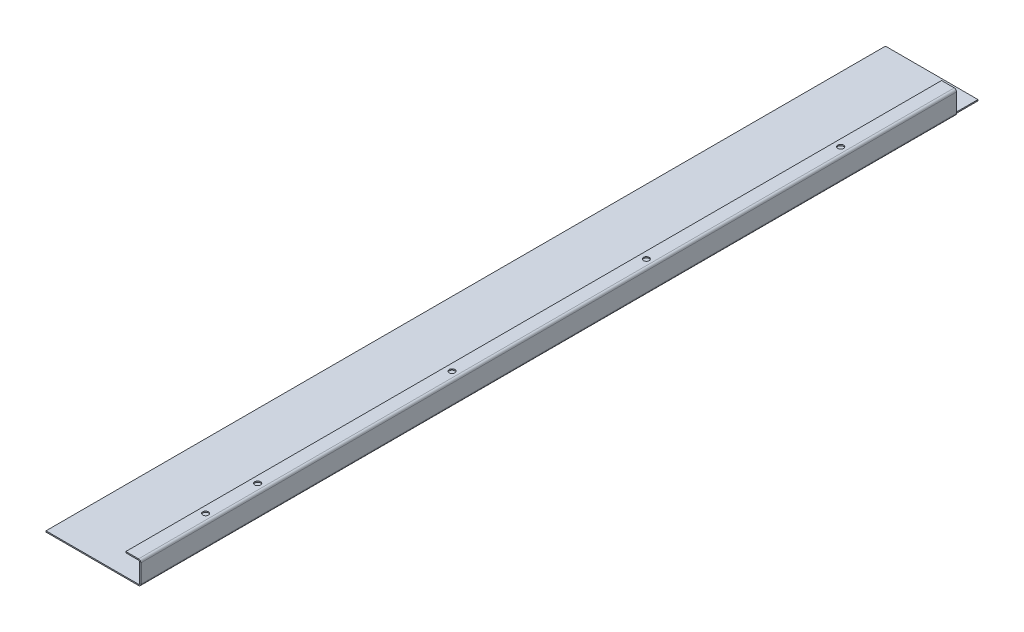
ISO-10303-21;
HEADER;
FILE_DESCRIPTION(('STEP AP214'),'2;1');
FILE_NAME('part.step','',(''),(''),'','','');
FILE_SCHEMA(('AUTOMOTIVE_DESIGN { 1 0 10303 214 1 1 1 1 }'));
ENDSEC;
DATA;
#1=APPLICATION_CONTEXT('core data for automotive mechanical design processes');
#2=APPLICATION_PROTOCOL_DEFINITION('international standard','automotive_design',2000,#1);
#3=PRODUCT_CONTEXT('',#1,'mechanical');
#4=PRODUCT('Part','Part','',(#3));
#5=PRODUCT_RELATED_PRODUCT_CATEGORY('part','',(#4));
#6=PRODUCT_DEFINITION_FORMATION('','',#4);
#7=PRODUCT_DEFINITION_CONTEXT('part definition',#1,'design');
#8=PRODUCT_DEFINITION('design','',#6,#7);
#9=PRODUCT_DEFINITION_SHAPE('','',#8);
#10=(LENGTH_UNIT() NAMED_UNIT(*) SI_UNIT(.MILLI.,.METRE.));
#11=(NAMED_UNIT(*) PLANE_ANGLE_UNIT() SI_UNIT($,.RADIAN.));
#12=(NAMED_UNIT(*) SI_UNIT($,.STERADIAN.) SOLID_ANGLE_UNIT());
#13=UNCERTAINTY_MEASURE_WITH_UNIT(LENGTH_MEASURE(1.E-05),#10,'distance_accuracy_value','');
#14=(GEOMETRIC_REPRESENTATION_CONTEXT(3) GLOBAL_UNCERTAINTY_ASSIGNED_CONTEXT((#13)) GLOBAL_UNIT_ASSIGNED_CONTEXT((#10,
#11,#12)) REPRESENTATION_CONTEXT('',''));
#15=CARTESIAN_POINT('',(0.,0.,0.));
#16=DIRECTION('',(0.,0.,1.));
#17=DIRECTION('',(1.,0.,0.));
#18=AXIS2_PLACEMENT_3D('',#15,#16,#17);
#19=CARTESIAN_POINT('',(82.,-3.02959534033787E-13,0.));
#20=DIRECTION('',(-1.,0.,0.));
#21=DIRECTION('',(0.,-1.,0.));
#22=AXIS2_PLACEMENT_3D('',#19,#20,#21);
#23=PLANE('',#22);
#24=DIRECTION('',(0.,-1.,0.));
#25=VECTOR('',#24,1.);
#26=CARTESIAN_POINT('',(81.9999999999999,0.,-705.2));
#27=LINE('',#26,#25);
#28=CARTESIAN_POINT('',(81.9999999999999,17.,-705.2));
#29=VERTEX_POINT('',#28);
#30=CARTESIAN_POINT('',(81.9999999999998,0.999999999999959,-705.2));
#31=VERTEX_POINT('',#30);
#32=EDGE_CURVE('E346',#29,#31,#27,.T.);
#33=ORIENTED_EDGE('',*,*,#32,.F.);
#34=DIRECTION('',(0.,0.,-1.));
#35=VECTOR('',#34,1.);
#36=CARTESIAN_POINT('',(82.,17.,-725.7));
#37=LINE('',#36,#35);
#38=CARTESIAN_POINT('',(82.,17.,0.));
#39=VERTEX_POINT('',#38);
#40=EDGE_CURVE('E216',#29,#39,#37,.F.);
#41=ORIENTED_EDGE('',*,*,#40,.T.);
#42=DIRECTION('',(0.,-1.,0.));
#43=VECTOR('',#42,1.);
#44=CARTESIAN_POINT('',(82.,-3.02959534033787E-13,0.));
#45=LINE('',#44,#43);
#46=CARTESIAN_POINT('',(82.,1.00000000000001,0.));
#47=VERTEX_POINT('',#46);
#48=EDGE_CURVE('E229',#39,#47,#45,.T.);
#49=ORIENTED_EDGE('',*,*,#48,.T.);
#50=DIRECTION('',(0.,0.,-1.));
#51=VECTOR('',#50,1.);
#52=CARTESIAN_POINT('',(82.,0.999999999999997,0.));
#53=LINE('',#52,#51);
#54=EDGE_CURVE('E235',#31,#47,#53,.F.);
#55=ORIENTED_EDGE('',*,*,#54,.F.);
#56=EDGE_LOOP('',(#33,#41,#49,#55));
#57=FACE_BOUND('',#56,.T.);
#58=ADVANCED_FACE('F78',(#57),#23,.F.);
#59=CARTESIAN_POINT('',(81.,-2.99468052694944E-13,0.));
#60=DIRECTION('',(-1.,0.,0.));
#61=DIRECTION('',(0.,-1.,0.));
#62=AXIS2_PLACEMENT_3D('',#59,#60,#61);
#63=PLANE('',#62);
#64=DIRECTION('',(0.,0.,-1.));
#65=VECTOR('',#64,1.);
#66=CARTESIAN_POINT('',(81.,17.,-725.7));
#67=LINE('',#66,#65);
#68=CARTESIAN_POINT('',(81.,17.,-705.2));
#69=VERTEX_POINT('',#68);
#70=CARTESIAN_POINT('',(81.,17.,0.));
#71=VERTEX_POINT('',#70);
#72=EDGE_CURVE('E223',#69,#71,#67,.F.);
#73=ORIENTED_EDGE('',*,*,#72,.F.);
#74=DIRECTION('',(0.,-1.,0.));
#75=VECTOR('',#74,1.);
#76=CARTESIAN_POINT('',(80.9999999999998,-2.99307484610677E-13,-705.2));
#77=LINE('',#76,#75);
#78=CARTESIAN_POINT('',(80.9999999999998,0.999999999999935,-705.2));
#79=VERTEX_POINT('',#78);
#80=EDGE_CURVE('E347',#69,#79,#77,.T.);
#81=ORIENTED_EDGE('',*,*,#80,.T.);
#82=DIRECTION('',(0.,0.,-1.));
#83=VECTOR('',#82,1.);
#84=CARTESIAN_POINT('',(81.,1.,0.));
#85=LINE('',#84,#83);
#86=CARTESIAN_POINT('',(81.,1.00000000000001,0.));
#87=VERTEX_POINT('',#86);
#88=EDGE_CURVE('E237',#87,#79,#85,.T.);
#89=ORIENTED_EDGE('',*,*,#88,.F.);
#90=DIRECTION('',(0.,1.,0.));
#91=VECTOR('',#90,1.);
#92=CARTESIAN_POINT('',(81.,0.,0.));
#93=LINE('',#92,#91);
#94=EDGE_CURVE('E233',#71,#87,#93,.F.);
#95=ORIENTED_EDGE('',*,*,#94,.F.);
#96=EDGE_LOOP('',(#73,#81,#89,#95));
#97=FACE_BOUND('',#96,.T.);
#98=ADVANCED_FACE('F388',(#97),#63,.T.);
#99=CARTESIAN_POINT('',(79.9999999999999,0.999999999999937,-725.7));
#100=DIRECTION('',(0.,0.,-1.));
#101=DIRECTION('',(1.,0.,0.));
#102=AXIS2_PLACEMENT_3D('',#99,#100,#101);
#103=CYLINDRICAL_SURFACE('',#102,2.00000000000008);
#104=DIRECTION('',(0.,0.,-1.));
#105=VECTOR('',#104,1.);
#106=CARTESIAN_POINT('',(79.9999999999998,-1.00000000000015,-725.7));
#107=LINE('',#106,#105);
#108=CARTESIAN_POINT('',(79.9999999999998,-1.00000000000014,-705.2));
#109=VERTEX_POINT('',#108);
#110=CARTESIAN_POINT('',(79.9999999999998,-1.,0.));
#111=VERTEX_POINT('',#110);
#112=EDGE_CURVE('E103',#109,#111,#107,.F.);
#113=ORIENTED_EDGE('',*,*,#112,.F.);
#114=CARTESIAN_POINT('',(79.9999999999998,0.999999999999856,-705.2));
#115=DIRECTION('',(0.,0.,1.));
#116=DIRECTION('',(1.,0.,0.));
#117=AXIS2_PLACEMENT_3D('',#114,#115,#116);
#118=CIRCLE('',#117,2.);
#119=EDGE_CURVE('E318',#109,#31,#118,.T.);
#120=ORIENTED_EDGE('',*,*,#119,.T.);
#121=ORIENTED_EDGE('',*,*,#54,.T.);
#122=CARTESIAN_POINT('',(79.9999999999999,1.00000000000002,0.));
#123=DIRECTION('',(0.,0.,-1.));
#124=DIRECTION('',(0.,1.,0.));
#125=AXIS2_PLACEMENT_3D('',#122,#123,#124);
#126=CIRCLE('',#125,2.00000000000008);
#127=EDGE_CURVE('E244',#111,#47,#126,.F.);
#128=ORIENTED_EDGE('',*,*,#127,.F.);
#129=EDGE_LOOP('',(#113,#120,#121,#128));
#130=FACE_BOUND('',#129,.T.);
#131=ADVANCED_FACE('F394',(#130),#103,.T.);
#132=CARTESIAN_POINT('',(79.9999999999999,0.999999999999937,-725.7));
#133=DIRECTION('',(0.,0.,-1.));
#134=DIRECTION('',(1.,0.,0.));
#135=AXIS2_PLACEMENT_3D('',#132,#133,#134);
#136=CYLINDRICAL_SURFACE('',#135,1.00000000000008);
#137=CARTESIAN_POINT('',(79.9999999999998,0.999999999999855,-705.2));
#138=DIRECTION('',(0.,0.,1.));
#139=DIRECTION('',(0.,-1.,0.));
#140=AXIS2_PLACEMENT_3D('',#137,#138,#139);
#141=CIRCLE('',#140,1.);
#142=CARTESIAN_POINT('',(79.9999999999998,-1.44578359700942E-13,-705.2));
#143=VERTEX_POINT('',#142);
#144=EDGE_CURVE('E324',#143,#79,#141,.T.);
#145=ORIENTED_EDGE('',*,*,#144,.F.);
#146=DIRECTION('',(0.,0.,-1.));
#147=VECTOR('',#146,1.);
#148=CARTESIAN_POINT('',(79.9999999999998,-1.46800974154537E-13,-725.7));
#149=LINE('',#148,#147);
#150=CARTESIAN_POINT('',(79.9999999999998,0.,0.));
#151=VERTEX_POINT('',#150);
#152=EDGE_CURVE('E232',#143,#151,#149,.F.);
#153=ORIENTED_EDGE('',*,*,#152,.T.);
#154=CARTESIAN_POINT('',(79.9999999999999,1.00000000000002,0.));
#155=DIRECTION('',(0.,0.,-1.));
#156=DIRECTION('',(0.,1.,0.));
#157=AXIS2_PLACEMENT_3D('',#154,#155,#156);
#158=CIRCLE('',#157,1.00000000000008);
#159=EDGE_CURVE('E248',#151,#87,#158,.F.);
#160=ORIENTED_EDGE('',*,*,#159,.T.);
#161=ORIENTED_EDGE('',*,*,#88,.T.);
#162=EDGE_LOOP('',(#145,#153,#160,#161));
#163=FACE_BOUND('',#162,.T.);
#164=ADVANCED_FACE('F409',(#163),#136,.F.);
#165=CARTESIAN_POINT('',(80.,17.,-725.7));
#166=DIRECTION('',(0.,0.,-1.));
#167=DIRECTION('',(0.,1.,0.));
#168=AXIS2_PLACEMENT_3D('',#165,#166,#167);
#169=CYLINDRICAL_SURFACE('',#168,2.);
#170=ORIENTED_EDGE('',*,*,#40,.F.);
#171=CARTESIAN_POINT('',(80.,17.,-705.2));
#172=DIRECTION('',(0.,0.,1.));
#173=DIRECTION('',(1.,0.,0.));
#174=AXIS2_PLACEMENT_3D('',#171,#172,#173);
#175=CIRCLE('',#174,2.);
#176=CARTESIAN_POINT('',(79.9999999999997,19.0000000000001,-705.2));
#177=VERTEX_POINT('',#176);
#178=EDGE_CURVE('E182',#29,#177,#175,.T.);
#179=ORIENTED_EDGE('',*,*,#178,.T.);
#180=DIRECTION('',(0.,0.,-1.));
#181=VECTOR('',#180,1.);
#182=CARTESIAN_POINT('',(80.0000000000001,19.,0.));
#183=LINE('',#182,#181);
#184=CARTESIAN_POINT('',(80.,19.,0.));
#185=VERTEX_POINT('',#184);
#186=EDGE_CURVE('E208',#177,#185,#183,.F.);
#187=ORIENTED_EDGE('',*,*,#186,.T.);
#188=CARTESIAN_POINT('',(80.,17.,0.));
#189=DIRECTION('',(0.,0.,-1.));
#190=DIRECTION('',(-1.,0.,0.));
#191=AXIS2_PLACEMENT_3D('',#188,#189,#190);
#192=CIRCLE('',#191,2.);
#193=EDGE_CURVE('E218',#39,#185,#192,.F.);
#194=ORIENTED_EDGE('',*,*,#193,.F.);
#195=EDGE_LOOP('',(#170,#179,#187,#194));
#196=FACE_BOUND('',#195,.T.);
#197=ADVANCED_FACE('F413',(#196),#169,.T.);
#198=CARTESIAN_POINT('',(80.,17.,-725.7));
#199=DIRECTION('',(0.,0.,-1.));
#200=DIRECTION('',(0.,1.,0.));
#201=AXIS2_PLACEMENT_3D('',#198,#199,#200);
#202=CYLINDRICAL_SURFACE('',#201,1.);
#203=CARTESIAN_POINT('',(80.,17.,-705.2));
#204=DIRECTION('',(0.,0.,1.));
#205=DIRECTION('',(1.,0.,0.));
#206=AXIS2_PLACEMENT_3D('',#203,#204,#205);
#207=CIRCLE('',#206,1.);
#208=CARTESIAN_POINT('',(80.0000000000001,18.,-705.2));
#209=VERTEX_POINT('',#208);
#210=EDGE_CURVE('E183',#69,#209,#207,.T.);
#211=ORIENTED_EDGE('',*,*,#210,.F.);
#212=ORIENTED_EDGE('',*,*,#72,.T.);
#213=CARTESIAN_POINT('',(80.,17.,0.));
#214=DIRECTION('',(0.,0.,-1.));
#215=DIRECTION('',(-1.,0.,0.));
#216=AXIS2_PLACEMENT_3D('',#213,#214,#215);
#217=CIRCLE('',#216,1.);
#218=CARTESIAN_POINT('',(80.,18.,0.));
#219=VERTEX_POINT('',#218);
#220=EDGE_CURVE('E207',#71,#219,#217,.F.);
#221=ORIENTED_EDGE('',*,*,#220,.T.);
#222=DIRECTION('',(0.,0.,-1.));
#223=VECTOR('',#222,1.);
#224=CARTESIAN_POINT('',(80.0000000000001,18.,0.));
#225=LINE('',#224,#223);
#226=EDGE_CURVE('E199',#219,#209,#225,.T.);
#227=ORIENTED_EDGE('',*,*,#226,.T.);
#228=EDGE_LOOP('',(#211,#212,#221,#227));
#229=FACE_BOUND('',#228,.T.);
#230=ADVANCED_FACE('F205',(#229),#202,.F.);
#231=CARTESIAN_POINT('',(1.40823756520345E-13,19.0000000000006,0.));
#232=DIRECTION('',(0.,-1.,0.));
#233=DIRECTION('',(1.,0.,0.));
#234=AXIS2_PLACEMENT_3D('',#231,#232,#233);
#235=PLANE('',#234);
#236=CARTESIAN_POINT('',(74.9999999999839,19.,-612.));
#237=DIRECTION('',(0.,1.,0.));
#238=DIRECTION('',(-1.,0.,0.));
#239=AXIS2_PLACEMENT_3D('',#236,#237,#238);
#240=CIRCLE('',#239,2.5);
#241=CARTESIAN_POINT('',(72.4999999999839,19.0000000000001,-612.));
#242=VERTEX_POINT('',#241);
#243=EDGE_CURVE('E315',#242,#242,#240,.T.);
#244=ORIENTED_EDGE('',*,*,#243,.F.);
#245=EDGE_LOOP('',(#244));
#246=FACE_BOUND('',#245,.T.);
#247=CARTESIAN_POINT('',(74.9999999999892,19.,-444.));
#248=DIRECTION('',(0.,1.,0.));
#249=DIRECTION('',(-1.,0.,0.));
#250=AXIS2_PLACEMENT_3D('',#247,#248,#249);
#251=CIRCLE('',#250,2.5);
#252=CARTESIAN_POINT('',(72.4999999999892,19.0000000000001,-444.));
#253=VERTEX_POINT('',#252);
#254=EDGE_CURVE('E317',#253,#253,#251,.T.);
#255=ORIENTED_EDGE('',*,*,#254,.F.);
#256=EDGE_LOOP('',(#255));
#257=FACE_BOUND('',#256,.T.);
#258=CARTESIAN_POINT('',(74.9999999999946,19.,-276.));
#259=DIRECTION('',(0.,1.,0.));
#260=DIRECTION('',(-1.,0.,0.));
#261=AXIS2_PLACEMENT_3D('',#258,#259,#260);
#262=CIRCLE('',#261,2.50000000000001);
#263=CARTESIAN_POINT('',(72.4999999999946,19.0000000000001,-276.));
#264=VERTEX_POINT('',#263);
#265=EDGE_CURVE('E321',#264,#264,#262,.T.);
#266=ORIENTED_EDGE('',*,*,#265,.F.);
#267=EDGE_LOOP('',(#266));
#268=FACE_BOUND('',#267,.T.);
#269=CARTESIAN_POINT('',(74.9999999999999,19.,-108.));
#270=DIRECTION('',(0.,1.,0.));
#271=DIRECTION('',(-1.,0.,0.));
#272=AXIS2_PLACEMENT_3D('',#269,#270,#271);
#273=CIRCLE('',#272,2.50000000000001);
#274=CARTESIAN_POINT('',(72.4999999999999,19.0000000000001,-108.));
#275=VERTEX_POINT('',#274);
#276=EDGE_CURVE('E362',#275,#275,#273,.T.);
#277=ORIENTED_EDGE('',*,*,#276,.F.);
#278=EDGE_LOOP('',(#277));
#279=FACE_BOUND('',#278,.T.);
#280=CARTESIAN_POINT('',(74.9999999999999,19.,-63.));
#281=DIRECTION('',(0.,1.,0.));
#282=DIRECTION('',(-1.,0.,0.));
#283=AXIS2_PLACEMENT_3D('',#280,#281,#282);
#284=CIRCLE('',#283,2.5);
#285=CARTESIAN_POINT('',(72.4999999999999,19.0000000000001,-63.));
#286=VERTEX_POINT('',#285);
#287=EDGE_CURVE('E280',#286,#286,#284,.T.);
#288=ORIENTED_EDGE('',*,*,#287,.F.);
#289=EDGE_LOOP('',(#288));
#290=FACE_BOUND('',#289,.T.);
#291=DIRECTION('',(1.,0.,0.));
#292=VECTOR('',#291,1.);
#293=CARTESIAN_POINT('',(-2.91433543964104E-13,19.0000000000003,-705.2));
#294=LINE('',#293,#292);
#295=CARTESIAN_POINT('',(68.9999999999999,19.0000000000001,-705.2));
#296=VERTEX_POINT('',#295);
#297=EDGE_CURVE('E179',#296,#177,#294,.T.);
#298=ORIENTED_EDGE('',*,*,#297,.F.);
#299=DIRECTION('',(0.,0.,1.));
#300=VECTOR('',#299,1.);
#301=CARTESIAN_POINT('',(69.0000000000001,19.0000000000001,0.));
#302=LINE('',#301,#300);
#303=CARTESIAN_POINT('',(69.0000000000001,19.0000000000001,0.));
#304=VERTEX_POINT('',#303);
#305=EDGE_CURVE('E333',#296,#304,#302,.T.);
#306=ORIENTED_EDGE('',*,*,#305,.T.);
#307=DIRECTION('',(1.,0.,0.));
#308=VECTOR('',#307,1.);
#309=CARTESIAN_POINT('',(1.40823756520345E-13,19.0000000000006,0.));
#310=LINE('',#309,#308);
#311=EDGE_CURVE('E330',#304,#185,#310,.T.);
#312=ORIENTED_EDGE('',*,*,#311,.T.);
#313=ORIENTED_EDGE('',*,*,#186,.F.);
#314=EDGE_LOOP('',(#298,#306,#312,#313));
#315=FACE_BOUND('',#314,.T.);
#316=ADVANCED_FACE('F298',(#246,#257,#268,#279,#290,#315),#235,.F.);
#317=CARTESIAN_POINT('',(1.33680225758392E-13,18.0000000000006,0.));
#318=DIRECTION('',(0.,-1.,0.));
#319=DIRECTION('',(1.,0.,0.));
#320=AXIS2_PLACEMENT_3D('',#317,#318,#319);
#321=PLANE('',#320);
#322=CARTESIAN_POINT('',(74.9999999999999,18.,-63.));
#323=DIRECTION('',(0.,-1.,0.));
#324=DIRECTION('',(1.,0.,0.));
#325=AXIS2_PLACEMENT_3D('',#322,#323,#324);
#326=CIRCLE('',#325,2.5);
#327=CARTESIAN_POINT('',(77.4999999999999,18.,-63.));
#328=VERTEX_POINT('',#327);
#329=EDGE_CURVE('E82',#328,#328,#326,.T.);
#330=ORIENTED_EDGE('',*,*,#329,.F.);
#331=EDGE_LOOP('',(#330));
#332=FACE_BOUND('',#331,.T.);
#333=CARTESIAN_POINT('',(74.9999999999999,18.,-108.));
#334=DIRECTION('',(0.,-1.,0.));
#335=DIRECTION('',(1.,0.,0.));
#336=AXIS2_PLACEMENT_3D('',#333,#334,#335);
#337=CIRCLE('',#336,2.50000000000001);
#338=CARTESIAN_POINT('',(77.5,18.,-108.));
#339=VERTEX_POINT('',#338);
#340=EDGE_CURVE('E285',#339,#339,#337,.T.);
#341=ORIENTED_EDGE('',*,*,#340,.F.);
#342=EDGE_LOOP('',(#341));
#343=FACE_BOUND('',#342,.T.);
#344=CARTESIAN_POINT('',(74.9999999999946,18.,-276.));
#345=DIRECTION('',(0.,-1.,0.));
#346=DIRECTION('',(1.,0.,0.));
#347=AXIS2_PLACEMENT_3D('',#344,#345,#346);
#348=CIRCLE('',#347,2.50000000000001);
#349=CARTESIAN_POINT('',(77.4999999999946,18.,-276.));
#350=VERTEX_POINT('',#349);
#351=EDGE_CURVE('E283',#350,#350,#348,.T.);
#352=ORIENTED_EDGE('',*,*,#351,.F.);
#353=EDGE_LOOP('',(#352));
#354=FACE_BOUND('',#353,.T.);
#355=CARTESIAN_POINT('',(74.9999999999892,18.,-444.));
#356=DIRECTION('',(0.,-1.,0.));
#357=DIRECTION('',(1.,0.,0.));
#358=AXIS2_PLACEMENT_3D('',#355,#356,#357);
#359=CIRCLE('',#358,2.5);
#360=CARTESIAN_POINT('',(77.4999999999892,18.,-444.));
#361=VERTEX_POINT('',#360);
#362=EDGE_CURVE('E279',#361,#361,#359,.T.);
#363=ORIENTED_EDGE('',*,*,#362,.F.);
#364=EDGE_LOOP('',(#363));
#365=FACE_BOUND('',#364,.T.);
#366=CARTESIAN_POINT('',(74.9999999999839,18.,-612.));
#367=DIRECTION('',(0.,-1.,0.));
#368=DIRECTION('',(1.,0.,0.));
#369=AXIS2_PLACEMENT_3D('',#366,#367,#368);
#370=CIRCLE('',#369,2.5);
#371=CARTESIAN_POINT('',(77.4999999999839,18.,-612.));
#372=VERTEX_POINT('',#371);
#373=EDGE_CURVE('E276',#372,#372,#370,.T.);
#374=ORIENTED_EDGE('',*,*,#373,.F.);
#375=EDGE_LOOP('',(#374));
#376=FACE_BOUND('',#375,.T.);
#377=DIRECTION('',(0.,0.,-1.));
#378=VECTOR('',#377,1.);
#379=CARTESIAN_POINT('',(69.0000000000001,18.0000000000001,0.));
#380=LINE('',#379,#378);
#381=CARTESIAN_POINT('',(68.9999999999999,18.0000000000001,-705.2));
#382=VERTEX_POINT('',#381);
#383=CARTESIAN_POINT('',(69.0000000000001,18.0000000000001,0.));
#384=VERTEX_POINT('',#383);
#385=EDGE_CURVE('E201',#382,#384,#380,.F.);
#386=ORIENTED_EDGE('',*,*,#385,.F.);
#387=DIRECTION('',(1.,0.,0.));
#388=VECTOR('',#387,1.);
#389=CARTESIAN_POINT('',(1.33595742037108E-13,18.0000000000006,-705.2));
#390=LINE('',#389,#388);
#391=EDGE_CURVE('E95',#382,#209,#390,.T.);
#392=ORIENTED_EDGE('',*,*,#391,.T.);
#393=ORIENTED_EDGE('',*,*,#226,.F.);
#394=DIRECTION('',(-1.,0.,0.));
#395=VECTOR('',#394,1.);
#396=CARTESIAN_POINT('',(81.0000000000001,18.,0.));
#397=LINE('',#396,#395);
#398=EDGE_CURVE('E335',#384,#219,#397,.F.);
#399=ORIENTED_EDGE('',*,*,#398,.F.);
#400=EDGE_LOOP('',(#386,#392,#393,#399));
#401=FACE_BOUND('',#400,.T.);
#402=ADVANCED_FACE('F197',(#332,#343,#354,#365,#376,#401),#321,.T.);
#403=CARTESIAN_POINT('',(69.0000000000001,19.0000000000001,0.));
#404=DIRECTION('',(1.,0.,0.));
#405=DIRECTION('',(0.,1.,0.));
#406=AXIS2_PLACEMENT_3D('',#403,#404,#405);
#407=PLANE('',#406);
#408=DIRECTION('',(0.,1.,0.));
#409=VECTOR('',#408,1.);
#410=CARTESIAN_POINT('',(68.9999999999999,19.0000000000001,-705.2));
#411=LINE('',#410,#409);
#412=EDGE_CURVE('E202',#296,#382,#411,.F.);
#413=ORIENTED_EDGE('',*,*,#412,.T.);
#414=ORIENTED_EDGE('',*,*,#385,.T.);
#415=DIRECTION('',(0.,-1.,0.));
#416=VECTOR('',#415,1.);
#417=CARTESIAN_POINT('',(69.0000000000001,19.0000000000001,0.));
#418=LINE('',#417,#416);
#419=EDGE_CURVE('E225',#304,#384,#418,.T.);
#420=ORIENTED_EDGE('',*,*,#419,.F.);
#421=ORIENTED_EDGE('',*,*,#305,.F.);
#422=EDGE_LOOP('',(#413,#414,#420,#421));
#423=FACE_BOUND('',#422,.T.);
#424=ADVANCED_FACE('F297',(#423),#407,.F.);
#425=CARTESIAN_POINT('',(82.,0.,0.));
#426=DIRECTION('',(0.,0.,-1.));
#427=DIRECTION('',(-1.,0.,0.));
#428=AXIS2_PLACEMENT_3D('',#425,#426,#427);
#429=PLANE('',#428);
#430=DIRECTION('',(1.,0.,0.));
#431=VECTOR('',#430,1.);
#432=CARTESIAN_POINT('',(81.,17.,0.));
#433=LINE('',#432,#431);
#434=EDGE_CURVE('E221',#71,#39,#433,.T.);
#435=ORIENTED_EDGE('',*,*,#434,.F.);
#436=ORIENTED_EDGE('',*,*,#94,.T.);
#437=DIRECTION('',(-1.,0.,0.));
#438=VECTOR('',#437,1.);
#439=CARTESIAN_POINT('',(82.,0.999999999999997,0.));
#440=LINE('',#439,#438);
#441=EDGE_CURVE('E228',#87,#47,#440,.F.);
#442=ORIENTED_EDGE('',*,*,#441,.T.);
#443=ORIENTED_EDGE('',*,*,#48,.F.);
#444=EDGE_LOOP('',(#435,#436,#442,#443));
#445=FACE_BOUND('',#444,.T.);
#446=ADVANCED_FACE('F402',(#445),#429,.F.);
#447=CARTESIAN_POINT('',(-1.66533453693773E-13,-1.,-725.7));
#448=DIRECTION('',(0.,0.,-1.));
#449=DIRECTION('',(-1.,0.,0.));
#450=AXIS2_PLACEMENT_3D('',#447,#448,#449);
#451=PLANE('',#450);
#452=DIRECTION('',(-1.,0.,0.));
#453=VECTOR('',#452,1.);
#454=CARTESIAN_POINT('',(-1.66533453693773E-13,0.,-725.7));
#455=LINE('',#454,#453);
#456=CARTESIAN_POINT('',(79.9999999999998,-1.46800974154537E-13,-725.7));
#457=VERTEX_POINT('',#456);
#458=CARTESIAN_POINT('',(-1.66533453693773E-13,0.,-725.7));
#459=VERTEX_POINT('',#458);
#460=EDGE_CURVE('E264',#457,#459,#455,.T.);
#461=ORIENTED_EDGE('',*,*,#460,.F.);
#462=DIRECTION('',(0.,-1.,0.));
#463=VECTOR('',#462,1.);
#464=CARTESIAN_POINT('',(79.9999999999998,-1.46800974154537E-13,-725.7));
#465=LINE('',#464,#463);
#466=CARTESIAN_POINT('',(79.9999999999998,-1.00000000000015,-725.7));
#467=VERTEX_POINT('',#466);
#468=EDGE_CURVE('E247',#457,#467,#465,.T.);
#469=ORIENTED_EDGE('',*,*,#468,.T.);
#470=DIRECTION('',(-1.,0.,0.));
#471=VECTOR('',#470,1.);
#472=CARTESIAN_POINT('',(-1.66533453693773E-13,-1.,-725.7));
#473=LINE('',#472,#471);
#474=CARTESIAN_POINT('',(-1.66533453693773E-13,-1.,-725.7));
#475=VERTEX_POINT('',#474);
#476=EDGE_CURVE('E267',#467,#475,#473,.T.);
#477=ORIENTED_EDGE('',*,*,#476,.T.);
#478=DIRECTION('',(0.,1.,0.));
#479=VECTOR('',#478,1.);
#480=CARTESIAN_POINT('',(-1.66533453693773E-13,-1.,-725.7));
#481=LINE('',#480,#479);
#482=EDGE_CURVE('E13',#475,#459,#481,.T.);
#483=ORIENTED_EDGE('',*,*,#482,.T.);
#484=EDGE_LOOP('',(#461,#469,#477,#483));
#485=FACE_BOUND('',#484,.T.);
#486=ADVANCED_FACE('F405',(#485),#451,.T.);
#487=CARTESIAN_POINT('',(0.,-1.,0.));
#488=DIRECTION('',(0.,-1.,0.));
#489=DIRECTION('',(0.,0.,-1.));
#490=AXIS2_PLACEMENT_3D('',#487,#488,#489);
#491=PLANE('',#490);
#492=ORIENTED_EDGE('',*,*,#476,.F.);
#493=EDGE_CURVE('E242',#467,#109,#107,.F.);
#494=ORIENTED_EDGE('',*,*,#493,.T.);
#495=ORIENTED_EDGE('',*,*,#112,.T.);
#496=DIRECTION('',(1.,0.,0.));
#497=VECTOR('',#496,1.);
#498=CARTESIAN_POINT('',(0.,-1.,0.));
#499=LINE('',#498,#497);
#500=CARTESIAN_POINT('',(0.,-1.,0.));
#501=VERTEX_POINT('',#500);
#502=EDGE_CURVE('E263',#501,#111,#499,.T.);
#503=ORIENTED_EDGE('',*,*,#502,.F.);
#504=DIRECTION('',(0.,0.,1.));
#505=VECTOR('',#504,1.);
#506=CARTESIAN_POINT('',(0.,-1.,0.));
#507=LINE('',#506,#505);
#508=EDGE_CURVE('E260',#475,#501,#507,.T.);
#509=ORIENTED_EDGE('',*,*,#508,.F.);
#510=EDGE_LOOP('',(#492,#494,#495,#503,#509));
#511=FACE_BOUND('',#510,.T.);
#512=ADVANCED_FACE('F420',(#511),#491,.T.);
#513=CARTESIAN_POINT('',(0.,0.,0.));
#514=DIRECTION('',(0.,-1.,0.));
#515=DIRECTION('',(0.,0.,-1.));
#516=AXIS2_PLACEMENT_3D('',#513,#514,#515);
#517=PLANE('',#516);
#518=EDGE_CURVE('E251',#457,#143,#149,.F.);
#519=ORIENTED_EDGE('',*,*,#518,.F.);
#520=ORIENTED_EDGE('',*,*,#460,.T.);
#521=DIRECTION('',(0.,0.,1.));
#522=VECTOR('',#521,1.);
#523=CARTESIAN_POINT('',(0.,0.,0.));
#524=LINE('',#523,#522);
#525=CARTESIAN_POINT('',(0.,0.,0.));
#526=VERTEX_POINT('',#525);
#527=EDGE_CURVE('E257',#459,#526,#524,.T.);
#528=ORIENTED_EDGE('',*,*,#527,.T.);
#529=DIRECTION('',(1.,0.,0.));
#530=VECTOR('',#529,1.);
#531=CARTESIAN_POINT('',(0.,0.,0.));
#532=LINE('',#531,#530);
#533=EDGE_CURVE('E271',#526,#151,#532,.T.);
#534=ORIENTED_EDGE('',*,*,#533,.T.);
#535=ORIENTED_EDGE('',*,*,#152,.F.);
#536=EDGE_LOOP('',(#519,#520,#528,#534,#535));
#537=FACE_BOUND('',#536,.T.);
#538=ADVANCED_FACE('F423',(#537),#517,.F.);
#539=CARTESIAN_POINT('',(0.,-1.,0.));
#540=DIRECTION('',(-1.,0.,0.));
#541=DIRECTION('',(0.,0.,1.));
#542=AXIS2_PLACEMENT_3D('',#539,#540,#541);
#543=PLANE('',#542);
#544=ORIENTED_EDGE('',*,*,#527,.F.);
#545=ORIENTED_EDGE('',*,*,#482,.F.);
#546=ORIENTED_EDGE('',*,*,#508,.T.);
#547=DIRECTION('',(0.,1.,0.));
#548=VECTOR('',#547,1.);
#549=CARTESIAN_POINT('',(0.,-1.,0.));
#550=LINE('',#549,#548);
#551=EDGE_CURVE('E87',#501,#526,#550,.T.);
#552=ORIENTED_EDGE('',*,*,#551,.T.);
#553=EDGE_LOOP('',(#544,#545,#546,#552));
#554=FACE_BOUND('',#553,.T.);
#555=ADVANCED_FACE('F80',(#554),#543,.T.);
#556=CARTESIAN_POINT('',(0.,-1.,0.));
#557=DIRECTION('',(0.,0.,1.));
#558=DIRECTION('',(1.,0.,0.));
#559=AXIS2_PLACEMENT_3D('',#556,#557,#558);
#560=PLANE('',#559);
#561=DIRECTION('',(0.,-1.,0.));
#562=VECTOR('',#561,1.);
#563=CARTESIAN_POINT('',(79.9999999999998,0.,0.));
#564=LINE('',#563,#562);
#565=EDGE_CURVE('E254',#151,#111,#564,.T.);
#566=ORIENTED_EDGE('',*,*,#565,.F.);
#567=ORIENTED_EDGE('',*,*,#533,.F.);
#568=ORIENTED_EDGE('',*,*,#551,.F.);
#569=ORIENTED_EDGE('',*,*,#502,.T.);
#570=EDGE_LOOP('',(#566,#567,#568,#569));
#571=FACE_BOUND('',#570,.T.);
#572=ADVANCED_FACE('F418',(#571),#560,.T.);
#573=CARTESIAN_POINT('',(79.9999999999999,1.00000000000002,0.));
#574=DIRECTION('',(0.,0.,1.));
#575=DIRECTION('',(0.,-1.,0.));
#576=AXIS2_PLACEMENT_3D('',#573,#574,#575);
#577=PLANE('',#576);
#578=ORIENTED_EDGE('',*,*,#441,.F.);
#579=ORIENTED_EDGE('',*,*,#159,.F.);
#580=ORIENTED_EDGE('',*,*,#565,.T.);
#581=ORIENTED_EDGE('',*,*,#127,.T.);
#582=EDGE_LOOP('',(#578,#579,#580,#581));
#583=FACE_BOUND('',#582,.T.);
#584=ADVANCED_FACE('F415',(#583),#577,.T.);
#585=CARTESIAN_POINT('',(80.,17.,0.));
#586=DIRECTION('',(0.,0.,1.));
#587=DIRECTION('',(1.,0.,0.));
#588=AXIS2_PLACEMENT_3D('',#585,#586,#587);
#589=PLANE('',#588);
#590=DIRECTION('',(0.,-1.,0.));
#591=VECTOR('',#590,1.);
#592=CARTESIAN_POINT('',(80.0000000000001,19.,0.));
#593=LINE('',#592,#591);
#594=EDGE_CURVE('E209',#219,#185,#593,.F.);
#595=ORIENTED_EDGE('',*,*,#594,.F.);
#596=ORIENTED_EDGE('',*,*,#220,.F.);
#597=ORIENTED_EDGE('',*,*,#434,.T.);
#598=ORIENTED_EDGE('',*,*,#193,.T.);
#599=EDGE_LOOP('',(#595,#596,#597,#598));
#600=FACE_BOUND('',#599,.T.);
#601=ADVANCED_FACE('F399',(#600),#589,.T.);
#602=CARTESIAN_POINT('',(81.0000000000001,19.,0.));
#603=DIRECTION('',(0.,0.,-1.));
#604=DIRECTION('',(-1.,0.,0.));
#605=AXIS2_PLACEMENT_3D('',#602,#603,#604);
#606=PLANE('',#605);
#607=ORIENTED_EDGE('',*,*,#594,.T.);
#608=ORIENTED_EDGE('',*,*,#311,.F.);
#609=ORIENTED_EDGE('',*,*,#419,.T.);
#610=ORIENTED_EDGE('',*,*,#398,.T.);
#611=EDGE_LOOP('',(#607,#608,#609,#610));
#612=FACE_BOUND('',#611,.T.);
#613=ADVANCED_FACE('F311',(#612),#606,.F.);
#614=CARTESIAN_POINT('',(74.9999999999838,9.00000000000004,-612.));
#615=DIRECTION('',(0.,1.,0.));
#616=DIRECTION('',(-1.,0.,0.));
#617=AXIS2_PLACEMENT_3D('',#614,#615,#616);
#618=CYLINDRICAL_SURFACE('',#617,2.5);
#619=ORIENTED_EDGE('',*,*,#373,.T.);
#620=EDGE_LOOP('',(#619));
#621=FACE_BOUND('',#620,.T.);
#622=ORIENTED_EDGE('',*,*,#243,.T.);
#623=EDGE_LOOP('',(#622));
#624=FACE_BOUND('',#623,.T.);
#625=ADVANCED_FACE('F307',(#621,#624),#618,.F.);
#626=CARTESIAN_POINT('',(74.9999999999891,9.00000000000004,-444.));
#627=DIRECTION('',(0.,1.,0.));
#628=DIRECTION('',(-1.,0.,0.));
#629=AXIS2_PLACEMENT_3D('',#626,#627,#628);
#630=CYLINDRICAL_SURFACE('',#629,2.5);
#631=ORIENTED_EDGE('',*,*,#362,.T.);
#632=EDGE_LOOP('',(#631));
#633=FACE_BOUND('',#632,.T.);
#634=ORIENTED_EDGE('',*,*,#254,.T.);
#635=EDGE_LOOP('',(#634));
#636=FACE_BOUND('',#635,.T.);
#637=ADVANCED_FACE('F310',(#633,#636),#630,.F.);
#638=CARTESIAN_POINT('',(74.9999999999945,9.00000000000004,-276.));
#639=DIRECTION('',(0.,1.,0.));
#640=DIRECTION('',(-1.,0.,0.));
#641=AXIS2_PLACEMENT_3D('',#638,#639,#640);
#642=CYLINDRICAL_SURFACE('',#641,2.50000000000001);
#643=ORIENTED_EDGE('',*,*,#351,.T.);
#644=EDGE_LOOP('',(#643));
#645=FACE_BOUND('',#644,.T.);
#646=ORIENTED_EDGE('',*,*,#265,.T.);
#647=EDGE_LOOP('',(#646));
#648=FACE_BOUND('',#647,.T.);
#649=ADVANCED_FACE('F367',(#645,#648),#642,.F.);
#650=CARTESIAN_POINT('',(74.9999999999999,9.00000000000004,-108.));
#651=DIRECTION('',(0.,1.,0.));
#652=DIRECTION('',(-1.,0.,0.));
#653=AXIS2_PLACEMENT_3D('',#650,#651,#652);
#654=CYLINDRICAL_SURFACE('',#653,2.50000000000001);
#655=ORIENTED_EDGE('',*,*,#340,.T.);
#656=EDGE_LOOP('',(#655));
#657=FACE_BOUND('',#656,.T.);
#658=ORIENTED_EDGE('',*,*,#276,.T.);
#659=EDGE_LOOP('',(#658));
#660=FACE_BOUND('',#659,.T.);
#661=ADVANCED_FACE('F377',(#657,#660),#654,.F.);
#662=CARTESIAN_POINT('',(74.9999999999999,9.00000000000004,-63.));
#663=DIRECTION('',(0.,1.,0.));
#664=DIRECTION('',(-1.,0.,0.));
#665=AXIS2_PLACEMENT_3D('',#662,#663,#664);
#666=CYLINDRICAL_SURFACE('',#665,2.5);
#667=ORIENTED_EDGE('',*,*,#329,.T.);
#668=EDGE_LOOP('',(#667));
#669=FACE_BOUND('',#668,.T.);
#670=ORIENTED_EDGE('',*,*,#287,.T.);
#671=EDGE_LOOP('',(#670));
#672=FACE_BOUND('',#671,.T.);
#673=ADVANCED_FACE('F292',(#669,#672),#666,.F.);
#674=CARTESIAN_POINT('',(79.9999999999998,0.999999999999856,-705.2));
#675=DIRECTION('',(0.,0.,-1.));
#676=DIRECTION('',(-1.,0.,0.));
#677=AXIS2_PLACEMENT_3D('',#674,#675,#676);
#678=PLANE('',#677);
#679=DIRECTION('',(0.,-1.,0.));
#680=VECTOR('',#679,1.);
#681=CARTESIAN_POINT('',(79.9999999999999,0.,-705.2));
#682=LINE('',#681,#680);
#683=EDGE_CURVE('E356',#143,#109,#682,.T.);
#684=ORIENTED_EDGE('',*,*,#683,.F.);
#685=ORIENTED_EDGE('',*,*,#144,.T.);
#686=DIRECTION('',(-1.,0.,0.));
#687=VECTOR('',#686,1.);
#688=CARTESIAN_POINT('',(81.9999999999998,0.999999999999959,-705.2));
#689=LINE('',#688,#687);
#690=EDGE_CURVE('E354',#31,#79,#689,.T.);
#691=ORIENTED_EDGE('',*,*,#690,.F.);
#692=ORIENTED_EDGE('',*,*,#119,.F.);
#693=EDGE_LOOP('',(#684,#685,#691,#692));
#694=FACE_BOUND('',#693,.T.);
#695=ADVANCED_FACE('F376',(#694),#678,.T.);
#696=CARTESIAN_POINT('',(79.9999999999998,-1.4568966692774E-13,-715.45));
#697=DIRECTION('',(-1.,0.,0.));
#698=DIRECTION('',(0.,0.,-1.));
#699=AXIS2_PLACEMENT_3D('',#696,#697,#698);
#700=PLANE('',#699);
#701=ORIENTED_EDGE('',*,*,#468,.F.);
#702=ORIENTED_EDGE('',*,*,#518,.T.);
#703=ORIENTED_EDGE('',*,*,#683,.T.);
#704=ORIENTED_EDGE('',*,*,#493,.F.);
#705=EDGE_LOOP('',(#701,#702,#703,#704));
#706=FACE_BOUND('',#705,.T.);
#707=ADVANCED_FACE('F383',(#706),#700,.F.);
#708=CARTESIAN_POINT('',(80.,17.,-705.2));
#709=DIRECTION('',(0.,0.,-1.));
#710=DIRECTION('',(-1.,0.,0.));
#711=AXIS2_PLACEMENT_3D('',#708,#709,#710);
#712=PLANE('',#711);
#713=ORIENTED_EDGE('',*,*,#210,.T.);
#714=DIRECTION('',(0.,-1.,0.));
#715=VECTOR('',#714,1.);
#716=CARTESIAN_POINT('',(79.9999999999997,19.0000000000001,-705.2));
#717=LINE('',#716,#715);
#718=EDGE_CURVE('E175',#177,#209,#717,.T.);
#719=ORIENTED_EDGE('',*,*,#718,.F.);
#720=ORIENTED_EDGE('',*,*,#178,.F.);
#721=DIRECTION('',(-1.,0.,0.));
#722=VECTOR('',#721,1.);
#723=CARTESIAN_POINT('',(81.9999999999999,17.,-705.2));
#724=LINE('',#723,#722);
#725=EDGE_CURVE('E189',#29,#69,#724,.T.);
#726=ORIENTED_EDGE('',*,*,#725,.T.);
#727=EDGE_LOOP('',(#713,#719,#720,#726));
#728=FACE_BOUND('',#727,.T.);
#729=ADVANCED_FACE('F187',(#728),#712,.T.);
#730=CARTESIAN_POINT('',(81.9999999999999,0.,-705.2));
#731=DIRECTION('',(0.,0.,-1.));
#732=DIRECTION('',(0.,-1.,0.));
#733=AXIS2_PLACEMENT_3D('',#730,#731,#732);
#734=PLANE('',#733);
#735=ORIENTED_EDGE('',*,*,#725,.F.);
#736=ORIENTED_EDGE('',*,*,#32,.T.);
#737=ORIENTED_EDGE('',*,*,#690,.T.);
#738=ORIENTED_EDGE('',*,*,#80,.F.);
#739=EDGE_LOOP('',(#735,#736,#737,#738));
#740=FACE_BOUND('',#739,.T.);
#741=ADVANCED_FACE('F459',(#740),#734,.T.);
#742=CARTESIAN_POINT('',(-2.91433543964104E-13,19.0000000000003,-705.2));
#743=DIRECTION('',(0.,0.,-1.));
#744=DIRECTION('',(1.,0.,0.));
#745=AXIS2_PLACEMENT_3D('',#742,#743,#744);
#746=PLANE('',#745);
#747=ORIENTED_EDGE('',*,*,#412,.F.);
#748=ORIENTED_EDGE('',*,*,#297,.T.);
#749=ORIENTED_EDGE('',*,*,#718,.T.);
#750=ORIENTED_EDGE('',*,*,#391,.F.);
#751=EDGE_LOOP('',(#747,#748,#749,#750));
#752=FACE_BOUND('',#751,.T.);
#753=ADVANCED_FACE('F177',(#752),#746,.T.);
#754=CLOSED_SHELL('',(#58,#98,#131,#164,#197,#230,#316,#402,#424,#446,#486,#512,#538,#555,#572,
#584,#601,#613,#625,#637,#649,#661,#673,#695,#707,#729,#741,#753));
#755=MANIFOLD_SOLID_BREP('B2',#754);
#756=ADVANCED_BREP_SHAPE_REPRESENTATION('',(#18,#755),#14);
#757=SHAPE_DEFINITION_REPRESENTATION(#9,#756);
ENDSEC;
END-ISO-10303-21;
